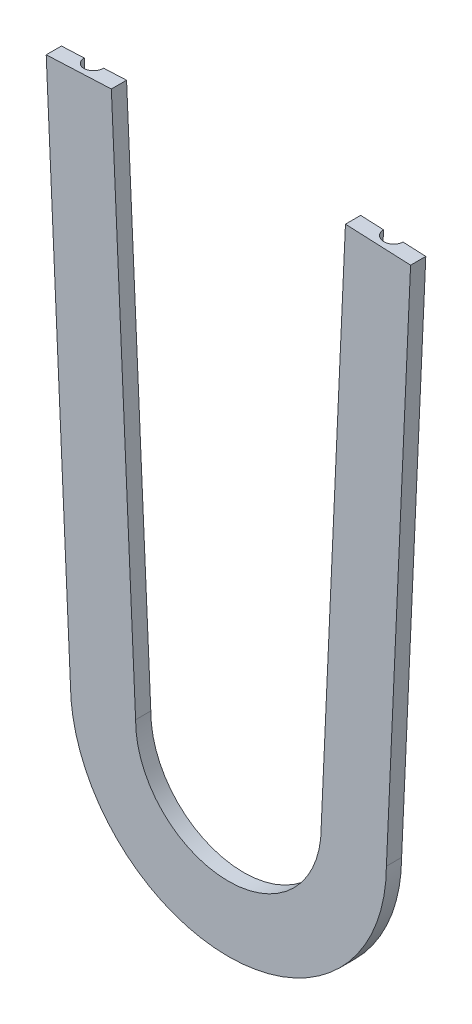
ISO-10303-21;
HEADER;
FILE_DESCRIPTION(('STEP AP214'),'2;1');
FILE_NAME('part.step','',(''),(''),'','','');
FILE_SCHEMA(('AUTOMOTIVE_DESIGN { 1 0 10303 214 1 1 1 1 }'));
ENDSEC;
DATA;
#1=APPLICATION_CONTEXT('core data for automotive mechanical design processes');
#2=APPLICATION_PROTOCOL_DEFINITION('international standard','automotive_design',2000,#1);
#3=PRODUCT_CONTEXT('',#1,'mechanical');
#4=PRODUCT('Part','Part','',(#3));
#5=PRODUCT_RELATED_PRODUCT_CATEGORY('part','',(#4));
#6=PRODUCT_DEFINITION_FORMATION('','',#4);
#7=PRODUCT_DEFINITION_CONTEXT('part definition',#1,'design');
#8=PRODUCT_DEFINITION('design','',#6,#7);
#9=PRODUCT_DEFINITION_SHAPE('','',#8);
#10=(LENGTH_UNIT() NAMED_UNIT(*) SI_UNIT(.MILLI.,.METRE.));
#11=(NAMED_UNIT(*) PLANE_ANGLE_UNIT() SI_UNIT($,.RADIAN.));
#12=(NAMED_UNIT(*) SI_UNIT($,.STERADIAN.) SOLID_ANGLE_UNIT());
#13=UNCERTAINTY_MEASURE_WITH_UNIT(LENGTH_MEASURE(1.E-05),#10,'distance_accuracy_value','');
#14=(GEOMETRIC_REPRESENTATION_CONTEXT(3) GLOBAL_UNCERTAINTY_ASSIGNED_CONTEXT((#13)) GLOBAL_UNIT_ASSIGNED_CONTEXT((#10,
#11,#12)) REPRESENTATION_CONTEXT('',''));
#15=CARTESIAN_POINT('',(0.,0.,0.));
#16=DIRECTION('',(0.,0.,1.));
#17=DIRECTION('',(1.,0.,0.));
#18=AXIS2_PLACEMENT_3D('',#15,#16,#17);
#19=CARTESIAN_POINT('',(0.,-604.4946,2.9464));
#20=DIRECTION('',(0.,0.,1.));
#21=DIRECTION('',(1.,0.,0.));
#22=AXIS2_PLACEMENT_3D('',#19,#20,#21);
#23=CYLINDRICAL_SURFACE('',#22,24.003);
#24=DIRECTION('',(0.,0.,-1.));
#25=VECTOR('',#24,1.);
#26=CARTESIAN_POINT('',(24.0027055961212,-604.613482570464,4.1021));
#27=LINE('',#26,#25);
#28=CARTESIAN_POINT('',(24.0027055961255,-604.613482570368,2.9464));
#29=VERTEX_POINT('',#28);
#30=CARTESIAN_POINT('',(24.0027055961255,-604.613482570368,5.2578));
#31=VERTEX_POINT('',#30);
#32=EDGE_CURVE('E268',#29,#31,#27,.F.);
#33=ORIENTED_EDGE('',*,*,#32,.T.);
#34=CARTESIAN_POINT('',(0.,-604.4946,5.2578));
#35=DIRECTION('',(0.,0.,1.));
#36=DIRECTION('',(1.,0.,0.));
#37=AXIS2_PLACEMENT_3D('',#34,#35,#36);
#38=CIRCLE('',#37,24.003);
#39=CARTESIAN_POINT('',(-24.0027055961255,-604.613482570368,5.2578));
#40=VERTEX_POINT('',#39);
#41=EDGE_CURVE('E162',#31,#40,#38,.F.);
#42=ORIENTED_EDGE('',*,*,#41,.T.);
#43=DIRECTION('',(0.,0.,1.));
#44=VECTOR('',#43,1.);
#45=CARTESIAN_POINT('',(-24.0027055961212,-604.613482570464,4.1021));
#46=LINE('',#45,#44);
#47=CARTESIAN_POINT('',(-24.0027055961249,-604.6134825705,2.9464));
#48=VERTEX_POINT('',#47);
#49=EDGE_CURVE('E271',#40,#48,#46,.F.);
#50=ORIENTED_EDGE('',*,*,#49,.T.);
#51=CARTESIAN_POINT('',(0.,-604.4946,2.9464));
#52=DIRECTION('',(0.,0.,1.));
#53=DIRECTION('',(1.,0.,0.));
#54=AXIS2_PLACEMENT_3D('',#51,#52,#53);
#55=CIRCLE('',#54,24.003);
#56=EDGE_CURVE('E158',#48,#29,#55,.T.);
#57=ORIENTED_EDGE('',*,*,#56,.T.);
#58=EDGE_LOOP('',(#33,#42,#50,#57));
#59=FACE_BOUND('',#58,.T.);
#60=ADVANCED_FACE('F17',(#59),#23,.T.);
#61=CARTESIAN_POINT('',(23.9292209206903,-606.231740783014,5.40652058941116));
#62=DIRECTION('',(0.998970569790712,-0.0453629881293202,0.));
#63=DIRECTION('',(0.,0.,-1.));
#64=AXIS2_PLACEMENT_3D('',#61,#62,#63);
#65=PLANE('',#64);
#66=DIRECTION('',(0.,0.,-1.));
#67=VECTOR('',#66,1.);
#68=CARTESIAN_POINT('',(27.6769393680293,-523.700571934905,4.1021));
#69=LINE('',#68,#67);
#70=CARTESIAN_POINT('',(27.6769393680304,-523.700571934905,2.9464));
#71=VERTEX_POINT('',#70);
#72=CARTESIAN_POINT('',(27.6769393680304,-523.700571934905,5.2578));
#73=VERTEX_POINT('',#72);
#74=EDGE_CURVE('E119',#71,#73,#69,.F.);
#75=ORIENTED_EDGE('',*,*,#74,.T.);
#76=DIRECTION('',(0.0453629881293202,0.998970569790712,0.));
#77=VECTOR('',#76,1.);
#78=CARTESIAN_POINT('',(23.9292209206903,-606.231740783014,5.2578));
#79=LINE('',#78,#77);
#80=EDGE_CURVE('E165',#73,#31,#79,.F.);
#81=ORIENTED_EDGE('',*,*,#80,.T.);
#82=ORIENTED_EDGE('',*,*,#32,.F.);
#83=DIRECTION('',(0.0453629881293202,0.998970569790712,0.));
#84=VECTOR('',#83,1.);
#85=CARTESIAN_POINT('',(23.9292209206903,-606.231740783014,2.9464));
#86=LINE('',#85,#84);
#87=EDGE_CURVE('E155',#29,#71,#86,.T.);
#88=ORIENTED_EDGE('',*,*,#87,.T.);
#89=EDGE_LOOP('',(#75,#81,#82,#88));
#90=FACE_BOUND('',#89,.T.);
#91=ADVANCED_FACE('F210',(#90),#65,.T.);
#92=CARTESIAN_POINT('',(20.5156996482297,-604.4946,2.79793188497368));
#93=CARTESIAN_POINT('',(20.6097988247181,-604.4946,3.72689316297742));
#94=CARTESIAN_POINT('',(19.9837150052592,-604.4946,4.41960000000006));
#95=CARTESIAN_POINT('',(19.05,-604.4946,4.41960000000006));
#96=CARTESIAN_POINT('',(18.1162849947408,-604.4946,4.41960000000006));
#97=CARTESIAN_POINT('',(17.490201175282,-604.4946,3.72689316297743));
#98=CARTESIAN_POINT('',(17.5843003517703,-604.4946,2.79793188497369));
#99=(BOUNDED_CURVE() B_SPLINE_CURVE(3,(#92,#93,#94,#95,#96,#97,#98),.UNSPECIFIED.,.F.,
.F.) B_SPLINE_CURVE_WITH_KNOTS((4,3,4),(0.,0.5,1.),
.UNSPECIFIED.) CURVE() GEOMETRIC_REPRESENTATION_ITEM() RATIONAL_B_SPLINE_CURVE((1.,
0.780353259779448,0.780353259779448,1.,0.780353259779448,0.780353259779448,1.)) REPRESENTATION_ITEM(''));
#100=CARTESIAN_POINT('',(0.,-604.4946,2.9464));
#101=DIRECTION('',(0.,0.,1.));
#102=AXIS1_PLACEMENT('',#100,#101);
#103=SURFACE_OF_REVOLUTION('',#99,#102);
#104=CARTESIAN_POINT('',(0.,-604.4946,2.9464));
#105=DIRECTION('',(0.,0.,1.));
#106=DIRECTION('',(1.,0.,0.));
#107=AXIS2_PLACEMENT_3D('',#104,#105,#106);
#108=CIRCLE('',#107,17.5767999999999);
#109=CARTESIAN_POINT('',(-17.5767694718907,-604.461840696414,2.94640000000061));
#110=VERTEX_POINT('',#109);
#111=CARTESIAN_POINT('',(17.5767694718895,-604.461840696414,2.9464));
#112=VERTEX_POINT('',#111);
#113=EDGE_CURVE('E135',#110,#112,#108,.T.);
#114=ORIENTED_EDGE('',*,*,#113,.T.);
#115=CARTESIAN_POINT('',(17.5767694718918,-604.461840696456,2.9464));
#116=CARTESIAN_POINT('',(17.5767688221751,-604.461832932138,2.97182810443926));
#117=CARTESIAN_POINT('',(17.5774277934015,-604.461837424337,2.99725616400642));
#118=CARTESIAN_POINT('',(17.5800617910486,-604.461870995725,3.04807052445029));
#119=CARTESIAN_POINT('',(17.5820381844576,-604.46190010046,3.0734567544667));
#120=CARTESIAN_POINT('',(17.5873018142634,-604.461982955642,3.12407332937669));
#121=CARTESIAN_POINT('',(17.5905880490891,-604.462036687263,3.1493037784536));
#122=CARTESIAN_POINT('',(17.5984521959019,-604.462168979468,3.19949590470834));
#123=CARTESIAN_POINT('',(17.603026759417,-604.462247475749,3.22445810674525));
#124=CARTESIAN_POINT('',(17.6134359270406,-604.4624295228,3.27400385820773));
#125=CARTESIAN_POINT('',(17.6192649110141,-604.46253296206,3.29858858889272));
#126=CARTESIAN_POINT('',(17.6321390739764,-604.462765181506,3.34727428993361));
#127=CARTESIAN_POINT('',(17.639176487765,-604.462893800585,3.37137731466718));
#128=CARTESIAN_POINT('',(17.6544124086054,-604.463176716781,3.41900087835389));
#129=CARTESIAN_POINT('',(17.6626011772786,-604.463330800258,3.44252453448193));
#130=CARTESIAN_POINT('',(17.6800745405739,-604.463665029549,3.48889844539359));
#131=CARTESIAN_POINT('',(17.6893476342921,-604.463844905724,3.51175303612439));
#132=CARTESIAN_POINT('',(17.708915537346,-604.464231143573,3.5567069083712));
#133=CARTESIAN_POINT('',(17.719197324151,-604.464437175724,3.57881186202356));
#134=CARTESIAN_POINT('',(17.7407011255539,-604.464876186337,3.62219449990189));
#135=CARTESIAN_POINT('',(17.751908858005,-604.465108771081,3.64347926843088));
#136=CARTESIAN_POINT('',(17.7751772503105,-604.465601356972,3.68516019003239));
#137=CARTESIAN_POINT('',(17.7872226419937,-604.465860895915,3.70556487324147));
#138=CARTESIAN_POINT('',(17.8120748390949,-604.466407938424,3.74543527512716));
#139=CARTESIAN_POINT('',(17.8248656663192,-604.466694905646,3.76491096228488));
#140=CARTESIAN_POINT('',(17.8511146133219,-604.467297145185,3.80288414988828));
#141=CARTESIAN_POINT('',(17.8645563144158,-604.467611806026,3.82139301100583));
#142=CARTESIAN_POINT('',(17.892011755078,-604.468270570325,3.85740426252524));
#143=CARTESIAN_POINT('',(17.9060088923428,-604.468613967223,3.87491932638239));
#144=CARTESIAN_POINT('',(17.9344804455695,-604.469328462663,3.90892546218932));
#145=CARTESIAN_POINT('',(17.94893830861,-604.469698813925,3.92543040818585));
#146=CARTESIAN_POINT('',(17.9782376197692,-604.470475863964,3.9574083151908));
#147=CARTESIAN_POINT('',(17.9930627885425,-604.470881540585,3.97289623029617));
#148=CARTESIAN_POINT('',(18.0263723282335,-604.471792374919,4.00620808617536));
#149=CARTESIAN_POINT('',(18.0450006072147,-604.472301342113,4.02388838889358));
#150=CARTESIAN_POINT('',(18.0831042593972,-604.473308724553,4.0582051625648));
#151=CARTESIAN_POINT('',(18.1025772284713,-604.473807164423,4.07484430411933));
#152=CARTESIAN_POINT('',(18.1422837811839,-604.474803224291,4.10702026953493));
#153=CARTESIAN_POINT('',(18.1625139853923,-604.475300839506,4.12256126328019));
#154=CARTESIAN_POINT('',(18.2036432767,-604.476292952307,4.15249182256927));
#155=CARTESIAN_POINT('',(18.2245381998087,-604.476787452314,4.16688711058257));
#156=CARTESIAN_POINT('',(18.2669017110995,-604.47777421062,4.19448744094801));
#157=CARTESIAN_POINT('',(18.2883655486972,-604.4782664619,4.20769977553701));
#158=CARTESIAN_POINT('',(18.3317694405629,-604.479248713048,4.23290577430237));
#159=CARTESIAN_POINT('',(18.3537043586186,-604.479738699745,4.24490828410737));
#160=CARTESIAN_POINT('',(18.397952124221,-604.480716605598,4.26767664714874));
#161=CARTESIAN_POINT('',(18.4202596471094,-604.481204502381,4.27845285020601));
#162=CARTESIAN_POINT('',(18.4651548047999,-604.482178318226,4.29876085121562));
#163=CARTESIAN_POINT('',(18.4877371146083,-604.482664205096,4.30830442412156));
#164=CARTESIAN_POINT('',(18.5330857386982,-604.48363407323,4.32614927674899));
#165=CARTESIAN_POINT('',(18.5558469018117,-604.484118011507,4.33446365117978));
#166=CARTESIAN_POINT('',(18.6014599669704,-604.485084017517,4.34986153426088));
#167=CARTESIAN_POINT('',(18.6243070480054,-604.48556603099,4.35695933003548));
#168=CARTESIAN_POINT('',(18.6700025297634,-604.486528192117,4.36994411434237));
#169=CARTESIAN_POINT('',(18.6928465752177,-604.487008273976,4.37584643789769));
#170=CARTESIAN_POINT('',(18.7384512729855,-604.487966546722,4.38646817770951));
#171=CARTESIAN_POINT('',(18.7612081487245,-604.488444660292,4.39120382010459));
#172=CARTESIAN_POINT('',(18.8065592083433,-604.489398944084,4.39952705135966));
#173=CARTESIAN_POINT('',(18.8291502837574,-604.489875025703,4.40313159361775));
#174=CARTESIAN_POINT('',(18.8740964064951,-604.490825168376,4.40923355844007));
#175=CARTESIAN_POINT('',(18.8964490794027,-604.491299129979,4.41174849439087));
#176=CARTESIAN_POINT('',(18.9408514276556,-604.492244933669,4.41571712847101));
#177=CARTESIAN_POINT('',(18.9628995057489,-604.492716666062,4.41718873750584));
#178=CARTESIAN_POINT('',(19.0066322815478,-604.493657892368,4.41912127413196));
#179=CARTESIAN_POINT('',(19.0283161815787,-604.494127267108,4.41960034110269));
#180=CARTESIAN_POINT('',(19.0499999999999,-604.4946,4.41960000000006));
#181=B_SPLINE_CURVE_WITH_KNOTS('',3,(#115,#116,#117,#118,#119,#120,#121,#122,#123,#124,#125,
#126,#127,#128,#129,#130,#131,#132,#133,#134,#135,#136,#137,#138,#139,#140,#141,#142,#143,#144,
#145,#146,#147,#148,#149,#150,#151,#152,#153,#154,#155,#156,#157,#158,#159,#160,#161,#162,#163,
#164,#165,#166,#167,#168,#169,#170,#171,#172,#173,#174,#175,#176,#177,#178,#179,#180),
.UNSPECIFIED.,.F.,.F.,(4,2,2,2,2,2,2,2,2,2,2,2,2,2,2,2,2,2,2,2,2,2,2,2,2,2,2,2,2,2,2,2,4),(0.,
0.0762757142904738,0.152630697511329,0.228927407509762,0.305027617710409,0.380793724839522,
0.456090039470174,0.530784028628657,0.604747481818089,0.677857575135833,0.749997812457862,
0.821058827651034,0.890939037138229,0.959545137565407,1.02679244851112,1.09260510489128,
1.15691610775577,1.23394344447498,1.31076433824077,1.38727582005754,1.46337741001955,
1.53897188043441,1.61396595550751,1.68827093598453,1.76180323973169,1.83448485199606,
1.9062436818919,1.97701382437458,2.04673572947713,2.11535628280573,2.18282880315587,
2.2491129645812,2.31417465131182),.UNSPECIFIED.);
#182=CARTESIAN_POINT('',(19.05,-604.4946,4.41960000000331));
#183=VERTEX_POINT('',#182);
#184=EDGE_CURVE('E120',#112,#183,#181,.T.);
#185=ORIENTED_EDGE('',*,*,#184,.T.);
#186=CARTESIAN_POINT('',(19.0499999999999,-604.4946,4.41960000000006));
#187=CARTESIAN_POINT('',(19.0704812848332,-604.495054903607,4.41960026390472));
#188=CARTESIAN_POINT('',(19.0909625960444,-604.495507013949,4.41917289414008));
#189=CARTESIAN_POINT('',(19.1316157404041,-604.496400122163,4.41747621351175));
#190=CARTESIAN_POINT('',(19.1517880461415,-604.496841187775,4.41621824995317));
#191=CARTESIAN_POINT('',(19.1917504012226,-604.497712001864,4.41289949509327));
#192=CARTESIAN_POINT('',(19.2115415128865,-604.498141819633,4.41085150584536));
#193=CARTESIAN_POINT('',(19.25067365338,-604.498989911692,4.40599922325951));
#194=CARTESIAN_POINT('',(19.270016428946,-604.499408255359,4.40320902183303));
#195=CARTESIAN_POINT('',(19.3081897431436,-604.500233167045,4.39692491467345));
#196=CARTESIAN_POINT('',(19.3270227844711,-604.500639803145,4.3934462144664));
#197=CARTESIAN_POINT('',(19.3641207370429,-604.501441061502,4.38584299290195));
#198=CARTESIAN_POINT('',(19.3823889534656,-604.501835749482,4.3817345992682));
#199=CARTESIAN_POINT('',(19.4183080393722,-604.502612871357,4.37293414289382));
#200=CARTESIAN_POINT('',(19.4359630377445,-604.502995367786,4.36825893205026));
#201=CARTESIAN_POINT('',(19.470613395538,-604.50374786698,4.35839026637256));
#202=CARTESIAN_POINT('',(19.4876137041073,-604.504117928495,4.35321418767368));
#203=CARTESIAN_POINT('',(19.5209194018604,-604.504845321777,4.34241148132214));
#204=CARTESIAN_POINT('',(19.5372305338281,-604.505202708127,4.33680255758241));
#205=CARTESIAN_POINT('',(19.5691295366957,-604.505904520791,4.32520316241555));
#206=CARTESIAN_POINT('',(19.5847238967027,-604.506248997329,4.31923053398668));
#207=CARTESIAN_POINT('',(19.615167766044,-604.506924768508,4.30697311233065));
#208=CARTESIAN_POINT('',(19.6300244448736,-604.507256108977,4.30070612451757));
#209=CARTESIAN_POINT('',(19.6589777216829,-604.507905394616,4.28792895329318));
#210=CARTESIAN_POINT('',(19.6730820911506,-604.50822338139,4.28143637407198));
#211=CARTESIAN_POINT('',(19.7005216904232,-604.508845762292,4.26827567317165));
#212=CARTESIAN_POINT('',(19.7138651949219,-604.509150193864,4.26162481314416));
#213=CARTESIAN_POINT('',(19.7397788381169,-604.509745262409,4.24821376855113));
#214=CARTESIAN_POINT('',(19.7523576815586,-604.510035933715,4.24147035803439));
#215=CARTESIAN_POINT('',(19.7880681851056,-604.51086680882,4.22165272525711));
#216=CARTESIAN_POINT('',(19.8109533782851,-604.511406210295,4.20813026327418));
#217=CARTESIAN_POINT('',(19.8536574622741,-604.512427827609,4.18131266426529));
#218=CARTESIAN_POINT('',(19.8735507132221,-604.512910254392,4.16813550904934));
#219=CARTESIAN_POINT('',(19.9103809680061,-604.513816968243,4.14243107736881));
#220=CARTESIAN_POINT('',(19.927391177791,-604.514241442243,4.13000865684453));
#221=CARTESIAN_POINT('',(19.9585949712799,-604.515031316485,4.10617835273115));
#222=CARTESIAN_POINT('',(19.9728578464678,-604.515396926222,4.09486114324349));
#223=CARTESIAN_POINT('',(19.9987205723937,-604.51606865003,4.07354688483802));
#224=CARTESIAN_POINT('',(20.0103833343648,-604.516374983056,4.06362595545849));
#225=CARTESIAN_POINT('',(20.0383056666797,-604.517115198784,4.03911325705635));
#226=CARTESIAN_POINT('',(20.0544027819445,-604.517547720985,4.0243350851679));
#227=CARTESIAN_POINT('',(20.07485847464,-604.518103100872,4.0046993692973));
#228=CARTESIAN_POINT('',(20.0795253211047,-604.518230209125,4.00015975015493));
#229=CARTESIAN_POINT('',(20.0866984534164,-604.51841735287,3.99308904919615));
#230=CARTESIAN_POINT('',(20.0892259098253,-604.518481691251,3.99057955312355));
#231=CARTESIAN_POINT('',(20.1095238414314,-604.518988979472,3.97027909611339));
#232=CARTESIAN_POINT('',(20.1268516310124,-604.519363627777,3.95203830129391));
#233=CARTESIAN_POINT('',(20.1605505953086,-604.520120262109,3.91469360641474));
#234=CARTESIAN_POINT('',(20.176921685446,-604.520502248782,3.89558963030868));
#235=CARTESIAN_POINT('',(20.208645668847,-604.521233835743,3.85659161843916));
#236=CARTESIAN_POINT('',(20.2239997805053,-604.521583474992,3.83669857546287));
#237=CARTESIAN_POINT('',(20.2536333093118,-604.522260476795,3.79620442698831));
#238=CARTESIAN_POINT('',(20.2679153402274,-604.522587893329,3.7756052346022));
#239=CARTESIAN_POINT('',(20.2953578801033,-604.523217232862,3.73378482874355));
#240=CARTESIAN_POINT('',(20.3085224589017,-604.523519248333,3.71256628739087));
#241=CARTESIAN_POINT('',(20.3336923650376,-604.524098171165,3.66959710072581));
#242=CARTESIAN_POINT('',(20.3457032507125,-604.524375198475,3.64784971269118));
#243=CARTESIAN_POINT('',(20.3685377102852,-604.524903610477,3.60391512092104));
#244=CARTESIAN_POINT('',(20.3793683316263,-604.525155146664,3.5817315816135));
#245=CARTESIAN_POINT('',(20.3998238943948,-604.525632332776,3.53701817580138));
#246=CARTESIAN_POINT('',(20.4094573431027,-604.525858164265,3.51449220282907));
#247=CARTESIAN_POINT('',(20.4275098152921,-604.526283668563,3.46918737770951));
#248=CARTESIAN_POINT('',(20.4359387480108,-604.526483553408,3.44641247564254));
#249=CARTESIAN_POINT('',(20.4515827950799,-604.526856950049,3.40070203691533));
#250=CARTESIAN_POINT('',(20.4588091369372,-604.527030704137,3.37777034425173));
#251=CARTESIAN_POINT('',(20.4720575360495,-604.527351660817,3.33183627664267));
#252=CARTESIAN_POINT('',(20.478092032961,-604.527499135905,3.30883749086651));
#253=CARTESIAN_POINT('',(20.4889746418258,-604.527767397551,3.26285591380229));
#254=CARTESIAN_POINT('',(20.4938362809494,-604.527888486679,3.23987632510572));
#255=CARTESIAN_POINT('',(20.5023987451432,-604.52810387918,3.19401568009945));
#256=CARTESIAN_POINT('',(20.5061140462679,-604.528198515035,3.17113732732311));
#257=CARTESIAN_POINT('',(20.5124163616109,-604.528360938943,3.12555682665382));
#258=CARTESIAN_POINT('',(20.5150186516442,-604.528429089229,3.1028567913681));
#259=CARTESIAN_POINT('',(20.5191333973779,-604.528538525598,3.05770513462279));
#260=CARTESIAN_POINT('',(20.5206617769895,-604.528580203282,3.03525496430048));
#261=CARTESIAN_POINT('',(20.5226729346885,-604.528636674839,2.99066936936566));
#262=CARTESIAN_POINT('',(20.5231721206259,-604.528651889965,2.9685346843213));
#263=CARTESIAN_POINT('',(20.5231717476144,-604.528653750536,2.9464));
#264=B_SPLINE_CURVE_WITH_KNOTS('',3,(#186,#187,#188,#189,#190,#191,#192,#193,#194,#195,#196,
#197,#198,#199,#200,#201,#202,#203,#204,#205,#206,#207,#208,#209,#210,#211,#212,#213,#214,#215,
#216,#217,#218,#219,#220,#221,#222,#223,#224,#225,#226,#227,#228,#229,#230,#231,#232,#233,#234,
#235,#236,#237,#238,#239,#240,#241,#242,#243,#244,#245,#246,#247,#248,#249,#250,#251,#252,#253,
#254,#255,#256,#257,#258,#259,#260,#261,#262,#263),.UNSPECIFIED.,.F.,.F.,(4,2,2,2,2,2,2,2,2,2,2,
2,2,2,2,2,2,2,2,2,2,2,2,2,2,2,2,2,2,2,2,2,2,2,2,2,2,2,4),(0.,0.0614544705741428,
0.122086275360216,0.181774254381958,0.240401168512197,0.2978544399828,0.354026791200259,
0.408816773509848,0.462129181240885,0.5138753499545,0.563973341142432,0.61234801856229,
0.658931023851332,0.703660660983625,0.746481700511611,0.826200473344976,0.897772789996084,
0.960956172794855,1.01557645834792,1.06151416360312,1.12705726442554,1.14659235674816,
1.15727914363559,1.23272652666714,1.30818056963037,1.38354251536967,1.45871431912662,
1.53359940958598,1.6081034213748,1.68213488542789,1.75560586511637,1.82843252789648,
1.90053564437337,1.97184100897814,2.04227977881398,2.11178872953268,2.18031042926114,
2.24779333353185,2.31419180582457),.UNSPECIFIED.);
#265=CARTESIAN_POINT('',(20.5231717476165,-604.52865375058,2.9464));
#266=VERTEX_POINT('',#265);
#267=EDGE_CURVE('E270',#183,#266,#264,.T.);
#268=ORIENTED_EDGE('',*,*,#267,.T.);
#269=CARTESIAN_POINT('',(0.,-604.4946,2.9464));
#270=DIRECTION('',(0.,0.,1.));
#271=DIRECTION('',(1.,0.,0.));
#272=AXIS2_PLACEMENT_3D('',#269,#270,#271);
#273=CIRCLE('',#272,20.5232000000001);
#274=CARTESIAN_POINT('',(-20.5231717476199,-604.528653750581,2.9464));
#275=VERTEX_POINT('',#274);
#276=EDGE_CURVE('E145',#266,#275,#273,.F.);
#277=ORIENTED_EDGE('',*,*,#276,.T.);
#278=CARTESIAN_POINT('',(-20.5231717476144,-604.528653750536,2.9464));
#279=CARTESIAN_POINT('',(-20.5231721027367,-604.528654315365,2.96831773397548));
#280=CARTESIAN_POINT('',(-20.5226826575368,-604.528641354406,2.99023547237425));
#281=CARTESIAN_POINT('',(-20.520709553491,-604.528589148788,3.0344109638125));
#282=CARTESIAN_POINT('',(-20.5192086261975,-604.528549447617,3.0566679462237));
#283=CARTESIAN_POINT('',(-20.5151644894583,-604.528443717272,3.10145989014064));
#284=CARTESIAN_POINT('',(-20.5126043756829,-604.528377261589,3.12399332550861));
#285=CARTESIAN_POINT('',(-20.5063987276617,-604.528217972036,3.16926982893223));
#286=CARTESIAN_POINT('',(-20.5027368209168,-604.528124741316,3.19201065252942));
#287=CARTESIAN_POINT('',(-20.4942896101194,-604.527911896461,3.23762755600592));
#288=CARTESIAN_POINT('',(-20.4894886234044,-604.527791915566,3.26050073104002));
#289=CARTESIAN_POINT('',(-20.4787315196584,-604.527525599565,3.30630239587291));
#290=CARTESIAN_POINT('',(-20.4727605687257,-604.527378927961,3.32922740062119));
#291=CARTESIAN_POINT('',(-20.4596388570448,-604.527059299082,3.37504782018436));
#292=CARTESIAN_POINT('',(-20.4524742628412,-604.526886035742,3.39793927209269));
#293=CARTESIAN_POINT('',(-20.4369484504515,-604.526513334403,3.44360347033785));
#294=CARTESIAN_POINT('',(-20.4285745400645,-604.526313620922,3.46637189973475));
#295=CARTESIAN_POINT('',(-20.410621850457,-604.525888163382,3.51169761815666));
#296=CARTESIAN_POINT('',(-20.4010316453183,-604.525662174431,3.53425037983527));
#297=CARTESIAN_POINT('',(-20.3806472796685,-604.525184382315,3.57905003138675));
#298=CARTESIAN_POINT('',(-20.369843064317,-604.52493236521,3.60129234436649));
#299=CARTESIAN_POINT('',(-20.3470412015446,-604.524402655574,3.64537519663182));
#300=CARTESIAN_POINT('',(-20.3350349508721,-604.524124779129,3.66721128400004));
#301=CARTESIAN_POINT('',(-20.3098494083774,-604.523543973163,3.71038585200198));
#302=CARTESIAN_POINT('',(-20.2966630174384,-604.523240892925,3.73172018973602));
#303=CARTESIAN_POINT('',(-20.2691476323842,-604.522608659743,3.77379669299588));
#304=CARTESIAN_POINT('',(-20.2548130659027,-604.522279379704,3.79453521255021));
#305=CARTESIAN_POINT('',(-20.2250413993362,-604.521600072722,3.83532837759756));
#306=CARTESIAN_POINT('',(-20.2096002427363,-604.521249970339,3.85538006215414));
#307=CARTESIAN_POINT('',(-20.1776659775653,-604.520510665636,3.89471090710023));
#308=CARTESIAN_POINT('',(-20.1611702889613,-604.520121365966,3.9139879689992));
#309=CARTESIAN_POINT('',(-20.1271831152614,-604.519374186546,3.95168935474278));
#310=CARTESIAN_POINT('',(-20.1096904464359,-604.519016345484,3.97011261575865));
#311=CARTESIAN_POINT('',(-20.0862394839597,-604.518398414452,3.99356630778662));
#312=CARTESIAN_POINT('',(-20.0806982286221,-604.518242734053,3.99902111883015));
#313=CARTESIAN_POINT('',(-20.0605985833834,-604.517682379082,4.01849622015164));
#314=CARTESIAN_POINT('',(-20.0457922726824,-604.517277680687,4.03226320309341));
#315=CARTESIAN_POINT('',(-20.019706425323,-604.516575220245,4.05553562146295));
#316=CARTESIAN_POINT('',(-20.0085559756208,-604.516278136251,4.06518668661289));
#317=CARTESIAN_POINT('',(-19.9836233888254,-604.515622013553,4.08612019137612));
#318=CARTESIAN_POINT('',(-19.9697758352239,-604.51526292784,4.09732493424928));
#319=CARTESIAN_POINT('',(-19.9392971557765,-604.5144831798,4.12108520195413));
#320=CARTESIAN_POINT('',(-19.922592782763,-604.514062419662,4.13354684193675));
#321=CARTESIAN_POINT('',(-19.8862540636987,-604.513160282795,4.15947443356139));
#322=CARTESIAN_POINT('',(-19.8665413231674,-604.512678809785,4.17283055689165));
#323=CARTESIAN_POINT('',(-19.8240614301276,-604.511656290333,4.20013368671603));
#324=CARTESIAN_POINT('',(-19.8012137809544,-604.511115100433,4.21395591640943));
#325=CARTESIAN_POINT('',(-19.7654946461555,-604.510280738901,4.23426027899934));
#326=CARTESIAN_POINT('',(-19.7528756591765,-604.509988152393,4.24119067772532));
#327=CARTESIAN_POINT('',(-19.7268406776049,-604.509388584787,4.25499642785219));
#328=CARTESIAN_POINT('',(-19.7134151335887,-604.509081574631,4.26185382010562));
#329=CARTESIAN_POINT('',(-19.6857688194101,-604.50845337882,4.2754438593619));
#330=CARTESIAN_POINT('',(-19.6715389365941,-604.508132159993,4.28215795930889));
#331=CARTESIAN_POINT('',(-19.6422907830007,-604.507475764968,4.29538956056721));
#332=CARTESIAN_POINT('',(-19.6272639239902,-604.507140550405,4.30188808497349));
#333=CARTESIAN_POINT('',(-19.5964351090552,-604.506456399832,4.31461468282353));
#334=CARTESIAN_POINT('',(-19.5806252049687,-604.506107420224,4.32082350502025));
#335=CARTESIAN_POINT('',(-19.5482503589704,-604.505395985767,4.33289577993993));
#336=CARTESIAN_POINT('',(-19.5316782027217,-604.505033481924,4.33873988889534));
#337=CARTESIAN_POINT('',(-19.4978061803944,-604.504295254901,4.35000760767113));
#338=CARTESIAN_POINT('',(-19.4804999137633,-604.503919477388,4.35541197916));
#339=CARTESIAN_POINT('',(-19.4451945592579,-604.503154965455,4.36572588908032));
#340=CARTESIAN_POINT('',(-19.427189943659,-604.502766171585,4.37061650756364));
#341=CARTESIAN_POINT('',(-19.3905305049491,-604.501975892914,4.37983044293396));
#342=CARTESIAN_POINT('',(-19.3718710623663,-604.50157434398,4.38413538133952));
#343=CARTESIAN_POINT('',(-19.3339522961736,-604.50075882108,4.39210848434211));
#344=CARTESIAN_POINT('',(-19.31468927003,-604.50034477897,4.39575904012622));
#345=CARTESIAN_POINT('',(-19.2756211791098,-604.499504531948,4.40235804354764));
#346=CARTESIAN_POINT('',(-19.2558133086962,-604.499078255821,4.40528987900302));
#347=CARTESIAN_POINT('',(-19.2157204972424,-604.498213794363,4.41039142228171));
#348=CARTESIAN_POINT('',(-19.1954335977801,-604.49777553595,4.41254573463423));
#349=CARTESIAN_POINT('',(-19.1544542275484,-604.496887354182,4.41603847924431));
#350=CARTESIAN_POINT('',(-19.1337605664297,-604.496437357445,4.41736293578106));
#351=CARTESIAN_POINT('',(-19.092044948216,-604.49552591655,4.41915002551012));
#352=CARTESIAN_POINT('',(-19.071022462373,-604.49506440038,4.41960029278877));
#353=CARTESIAN_POINT('',(-19.0499999999999,-604.4946,4.41960000000006));
#354=B_SPLINE_CURVE_WITH_KNOTS('',3,(#278,#279,#280,#281,#282,#283,#284,#285,#286,#287,#288,
#289,#290,#291,#292,#293,#294,#295,#296,#297,#298,#299,#300,#301,#302,#303,#304,#305,#306,#307,
#308,#309,#310,#311,#312,#313,#314,#315,#316,#317,#318,#319,#320,#321,#322,#323,#324,#325,#326,
#327,#328,#329,#330,#331,#332,#333,#334,#335,#336,#337,#338,#339,#340,#341,#342,#343,#344,#345,
#346,#347,#348,#349,#350,#351,#352,#353),.UNSPECIFIED.,.F.,.F.,(4,2,2,2,2,2,2,2,2,2,2,2,2,2,2,2,
2,2,2,2,2,2,2,2,2,2,2,2,2,2,2,2,2,2,2,2,2,4),(0.,0.0657477901151504,0.132647485541912,
0.200658797279614,0.269735345147605,0.339824599986281,0.410867897847443,0.482800532672695,
0.555551932544145,0.629045922827452,0.703201077451283,0.777931157240886,0.853145631731176,
0.928750278329714,1.00464785019939,1.08073880190889,1.15692205987796,1.1802532968102,
1.24089812346454,1.28514261202846,1.3385802732736,1.40109582892632,1.47251723810536,
1.55260025966384,1.59579460478483,1.64102291246815,1.68822770937761,1.73734441900341,
1.78830111121355,1.84101834171988,1.89540909500993,1.95137884278159,2.00882572771041,
2.06764087948619,2.12770886653358,2.18890828278851,2.25111246449825,2.31419032745121),.UNSPECIFIED.);
#355=CARTESIAN_POINT('',(-19.05,-604.4946,4.41960000000378));
#356=VERTEX_POINT('',#355);
#357=EDGE_CURVE('E191',#275,#356,#354,.T.);
#358=ORIENTED_EDGE('',*,*,#357,.T.);
#359=CARTESIAN_POINT('',(-19.0499999999999,-604.4946,4.41960000000006));
#360=CARTESIAN_POINT('',(-19.0283167763317,-604.494020535502,4.41960034246529));
#361=CARTESIAN_POINT('',(-19.0066332376235,-604.493452537755,4.41912130043692));
#362=CARTESIAN_POINT('',(-18.9629011736056,-604.492327612385,4.41718882960783));
#363=CARTESIAN_POINT('',(-18.9408534372271,-604.491771092687,4.4157172796177));
#364=CARTESIAN_POINT('',(-18.8964517613742,-604.490669133604,4.4117487793694));
#365=CARTESIAN_POINT('',(-18.8740994105965,-604.490124071217,4.409233935045));
#366=CARTESIAN_POINT('',(-18.8291539200996,-604.48904504038,4.40313217048717));
#367=CARTESIAN_POINT('',(-18.8065631464288,-604.488511418027,4.39952775245453));
#368=CARTESIAN_POINT('',(-18.7612126773355,-604.487455245874,4.3912047867542));
#369=CARTESIAN_POINT('',(-18.7384560822096,-604.486933010848,4.38646930008997));
#370=CARTESIAN_POINT('',(-18.6928519316802,-604.485899564988,4.37584788843192));
#371=CARTESIAN_POINT('',(-18.6700081448838,-604.485388637597,4.36994575059383));
#372=CARTESIAN_POINT('',(-18.6243131654951,-604.484377727385,4.35696135328398));
#373=CARTESIAN_POINT('',(-18.601466320406,-604.483877996883,4.34986377105528));
#374=CARTESIAN_POINT('',(-18.5558537114016,-604.482889369096,4.33446632884753));
#375=CARTESIAN_POINT('',(-18.5330927609281,-604.4824006935,4.32615219306472));
#376=CARTESIAN_POINT('',(-18.487744545821,-604.481434032093,4.30830782903041));
#377=CARTESIAN_POINT('',(-18.4651624249731,-604.480956238119,4.29876451652891));
#378=CARTESIAN_POINT('',(-18.4202676288721,-604.480011162886,4.27845704468889));
#379=CARTESIAN_POINT('',(-18.3979602714019,-604.479544044656,4.2676811200837));
#380=CARTESIAN_POINT('',(-18.3537128201883,-604.478620117126,4.2449133181799));
#381=CARTESIAN_POINT('',(-18.331778044035,-604.478163443438,4.23291110005738));
#382=CARTESIAN_POINT('',(-18.2883744221256,-604.47726015218,4.20770568666325));
#383=CARTESIAN_POINT('',(-18.2669107056439,-604.476813644244,4.19449365417982));
#384=CARTESIAN_POINT('',(-18.2245474179286,-604.475930474302,4.16689391841263));
#385=CARTESIAN_POINT('',(-18.2036525903753,-604.475493898314,4.15249893075254));
#386=CARTESIAN_POINT('',(-18.1625234978798,-604.474630089528,4.12256898462108));
#387=CARTESIAN_POINT('',(-18.1422933901927,-604.474202919612,4.10702831127441));
#388=CARTESIAN_POINT('',(-18.1025869508144,-604.473358403428,4.07485289320879));
#389=CARTESIAN_POINT('',(-18.0831139914034,-604.472941103773,4.05821398543002));
#390=CARTESIAN_POINT('',(-18.0450106225014,-604.472113014555,4.0238979600298));
#391=CARTESIAN_POINT('',(-18.0263826109124,-604.471702245436,4.00621817950761));
#392=CARTESIAN_POINT('',(-17.9897241675848,-604.470890793887,3.96955755992206));
#393=CARTESIAN_POINT('',(-17.9717122841583,-604.470490460641,3.95055816022169));
#394=CARTESIAN_POINT('',(-17.9368164411678,-604.469720993151,3.91172732897541));
#395=CARTESIAN_POINT('',(-17.9199271281106,-604.469351708207,3.89190071076098));
#396=CARTESIAN_POINT('',(-17.8873304868649,-604.468640770225,3.85151357761017));
#397=CARTESIAN_POINT('',(-17.8716161025066,-604.468298951121,3.83095876045926));
#398=CARTESIAN_POINT('',(-17.8414120575861,-604.467643291939,3.78921728825517));
#399=CARTESIAN_POINT('',(-17.8269136263704,-604.4673292504,3.76803698229143));
#400=CARTESIAN_POINT('',(-17.7991726434046,-604.466728502816,3.72514891428864));
#401=CARTESIAN_POINT('',(-17.7859196348834,-604.466441569034,3.70344791853073));
#402=CARTESIAN_POINT('',(-17.7606891163027,-604.465894713221,3.65962363109227));
#403=CARTESIAN_POINT('',(-17.7486995291521,-604.465634536139,3.63750729488025));
#404=CARTESIAN_POINT('',(-17.726004203635,-604.46514084726,3.59295677621547));
#405=CARTESIAN_POINT('',(-17.7152848674761,-604.464907054623,3.57052952311885));
#406=CARTESIAN_POINT('',(-17.6951276107931,-604.46446585961,3.52545952686369));
#407=CARTESIAN_POINT('',(-17.6856747003964,-604.464258150774,3.50282348983404));
#408=CARTESIAN_POINT('',(-17.6680377468556,-604.463868896817,3.45743493937869));
#409=CARTESIAN_POINT('',(-17.6598374738712,-604.463687019663,3.43468873423778));
#410=CARTESIAN_POINT('',(-17.644683950211,-604.463349257523,3.38917442817992));
#411=CARTESIAN_POINT('',(-17.637713399407,-604.463193014554,3.36641208860973));
#412=CARTESIAN_POINT('',(-17.6249891132473,-604.462906401431,3.32095474450351));
#413=CARTESIAN_POINT('',(-17.6192171886923,-604.462775646714,3.29826483255612));
#414=CARTESIAN_POINT('',(-17.6088525950867,-604.462539941953,3.25303548976335));
#415=CARTESIAN_POINT('',(-17.6042410347817,-604.462434579894,3.23050038874523));
#416=CARTESIAN_POINT('',(-17.5961533261772,-604.462249638894,3.18565717553876));
#417=CARTESIAN_POINT('',(-17.592657771711,-604.462169619495,3.16335256371975));
#418=CARTESIAN_POINT('',(-17.5867529687523,-604.46203539201,3.11903982379345));
#419=CARTESIAN_POINT('',(-17.584323982806,-604.46198071381,3.09703432573399));
#420=CARTESIAN_POINT('',(-17.5804991725922,-604.461897219305,3.05338207600661));
#421=CARTESIAN_POINT('',(-17.5790834514007,-604.46186790244,3.03173706710496));
#422=CARTESIAN_POINT('',(-17.5772283767484,-604.461835284587,2.98886079390779));
#423=CARTESIAN_POINT('',(-17.5767691397497,-604.461831450082,2.96763038866618));
#424=CARTESIAN_POINT('',(-17.5767694718918,-604.461840696456,2.9464));
#425=B_SPLINE_CURVE_WITH_KNOTS('',3,(#359,#360,#361,#362,#363,#364,#365,#366,#367,#368,#369,
#370,#371,#372,#373,#374,#375,#376,#377,#378,#379,#380,#381,#382,#383,#384,#385,#386,#387,#388,
#389,#390,#391,#392,#393,#394,#395,#396,#397,#398,#399,#400,#401,#402,#403,#404,#405,#406,#407,
#408,#409,#410,#411,#412,#413,#414,#415,#416,#417,#418,#419,#420,#421,#422,#423,#424),
.UNSPECIFIED.,.F.,.F.,(4,2,2,2,2,2,2,2,2,2,2,2,2,2,2,2,2,2,2,2,2,2,2,2,2,2,2,2,2,2,2,2,4),(0.,
0.0650676679712997,0.13135670521765,0.198833059112226,0.267456463062945,0.337180291417837,
0.407951481513924,0.479710531266688,0.552391579633015,0.62592257581004,0.700225541167758,
0.77521692569188,0.85080805820036,0.926905686881706,1.00341260389931,1.08022834504358,
1.1572499528313,1.23576253593141,1.31386891175438,1.39146053723142,1.46843313642019,
1.54468746500218,1.62012997503909,1.69467337119832,1.76823705330831,1.84074744367412,
1.91213820090926,1.98235032498942,2.05133216071407,2.1190393087146,2.18543445455519,
2.25048712734628,2.31417339967096),.UNSPECIFIED.);
#426=EDGE_CURVE('E231',#356,#110,#425,.T.);
#427=ORIENTED_EDGE('',*,*,#426,.T.);
#428=EDGE_LOOP('',(#114,#185,#268,#277,#358,#427));
#429=FACE_BOUND('',#428,.T.);
#430=ADVANCED_FACE('F200',(#429),#103,.F.);
#431=CARTESIAN_POINT('',(19.0263694039792,-605.014986132943,2.9464));
#432=DIRECTION('',(0.0453629881293724,0.998970569790709,0.));
#433=DIRECTION('',(-0.998970569790709,0.0453629881293724,0.));
#434=AXIS2_PLACEMENT_3D('',#431,#432,#433);
#435=CYLINDRICAL_SURFACE('',#434,1.47320000000655);
#436=DIRECTION('',(0.0453629881293724,0.998970569790709,0.));
#437=VECTOR('',#436,1.);
#438=CARTESIAN_POINT('',(17.554685960557,-604.948157378831,2.9464));
#439=LINE('',#438,#437);
#440=CARTESIAN_POINT('',(21.2573546924413,-523.409060300662,2.9464));
#441=VERTEX_POINT('',#440);
#442=EDGE_CURVE('E127',#112,#441,#439,.T.);
#443=ORIENTED_EDGE('',*,*,#442,.T.);
#444=CARTESIAN_POINT('',(22.729038135864,-523.475889054764,2.9464));
#445=DIRECTION('',(0.0453629881293724,0.998970569790709,0.));
#446=DIRECTION('',(-0.998970569790709,0.0453629881293724,0.));
#447=AXIS2_PLACEMENT_3D('',#444,#445,#446);
#448=CIRCLE('',#447,1.47320000000655);
#449=CARTESIAN_POINT('',(24.2007215792866,-523.542717808867,2.9464));
#450=VERTEX_POINT('',#449);
#451=EDGE_CURVE('E21',#441,#450,#448,.T.);
#452=ORIENTED_EDGE('',*,*,#451,.T.);
#453=DIRECTION('',(0.0453629881293724,0.998970569790709,0.));
#454=VECTOR('',#453,1.);
#455=CARTESIAN_POINT('',(20.4980528474015,-605.081814887055,2.9464));
#456=LINE('',#455,#454);
#457=EDGE_CURVE('E148',#450,#266,#456,.F.);
#458=ORIENTED_EDGE('',*,*,#457,.T.);
#459=ORIENTED_EDGE('',*,*,#267,.F.);
#460=ORIENTED_EDGE('',*,*,#184,.F.);
#461=EDGE_LOOP('',(#443,#452,#458,#459,#460));
#462=FACE_BOUND('',#461,.T.);
#463=ADVANCED_FACE('F132',(#462),#435,.F.);
#464=CARTESIAN_POINT('',(27.87485541731,-523.70955925011,2.79767941058884));
#465=DIRECTION('',(0.0453629881164068,0.998970569791298,0.));
#466=DIRECTION('',(-0.998970569791298,0.0453629881164068,0.));
#467=AXIS2_PLACEMENT_3D('',#464,#465,#466);
#468=PLANE('',#467);
#469=DIRECTION('',(-0.998970569791298,0.0453629881164068,0.));
#470=VECTOR('',#469,1.);
#471=CARTESIAN_POINT('',(27.87485541731,-523.70955925011,2.9464));
#472=LINE('',#471,#470);
#473=EDGE_CURVE('E114',#71,#450,#472,.T.);
#474=ORIENTED_EDGE('',*,*,#473,.T.);
#475=ORIENTED_EDGE('',*,*,#451,.F.);
#476=DIRECTION('',(-0.998970569791298,0.0453629881164068,0.));
#477=VECTOR('',#476,1.);
#478=CARTESIAN_POINT('',(27.87485541731,-523.70955925011,2.9464));
#479=LINE('',#478,#477);
#480=CARTESIAN_POINT('',(17.7811369036789,-523.251206174531,2.9464));
#481=VERTEX_POINT('',#480);
#482=EDGE_CURVE('E112',#441,#481,#479,.T.);
#483=ORIENTED_EDGE('',*,*,#482,.T.);
#484=DIRECTION('',(0.,0.,-1.));
#485=VECTOR('',#484,1.);
#486=CARTESIAN_POINT('',(17.7811369036831,-523.251206174438,4.1021));
#487=LINE('',#486,#485);
#488=CARTESIAN_POINT('',(17.7811369036789,-523.251206174531,5.2578));
#489=VERTEX_POINT('',#488);
#490=EDGE_CURVE('E178',#481,#489,#487,.F.);
#491=ORIENTED_EDGE('',*,*,#490,.T.);
#492=DIRECTION('',(-0.998970569791298,0.0453629881164068,0.));
#493=VECTOR('',#492,1.);
#494=CARTESIAN_POINT('',(27.87485541731,-523.70955925011,5.2578));
#495=LINE('',#494,#493);
#496=EDGE_CURVE('E168',#489,#73,#495,.F.);
#497=ORIENTED_EDGE('',*,*,#496,.T.);
#498=ORIENTED_EDGE('',*,*,#74,.F.);
#499=EDGE_LOOP('',(#474,#475,#483,#491,#497,#498));
#500=FACE_BOUND('',#499,.T.);
#501=ADVANCED_FACE('F111',(#500),#468,.T.);
#502=CARTESIAN_POINT('',(14.02292627321,-606.01343083711,2.79767941058884));
#503=DIRECTION('',(-0.998970569790718,0.0453629881291798,0.));
#504=DIRECTION('',(0.,0.,1.));
#505=AXIS2_PLACEMENT_3D('',#502,#503,#504);
#506=PLANE('',#505);
#507=ORIENTED_EDGE('',*,*,#490,.F.);
#508=DIRECTION('',(0.0453629881291798,0.998970569790718,0.));
#509=VECTOR('',#508,1.);
#510=CARTESIAN_POINT('',(14.02292627321,-606.01343083711,2.9464));
#511=LINE('',#510,#509);
#512=CARTESIAN_POINT('',(14.0966166777286,-604.390642118248,2.9464));
#513=VERTEX_POINT('',#512);
#514=EDGE_CURVE('E130',#481,#513,#511,.F.);
#515=ORIENTED_EDGE('',*,*,#514,.T.);
#516=DIRECTION('',(0.,0.,-1.));
#517=VECTOR('',#516,1.);
#518=CARTESIAN_POINT('',(14.0966166777288,-604.390642118254,4.1021));
#519=LINE('',#518,#517);
#520=CARTESIAN_POINT('',(14.0966166777286,-604.390642118248,5.2578));
#521=VERTEX_POINT('',#520);
#522=EDGE_CURVE('E175',#513,#521,#519,.F.);
#523=ORIENTED_EDGE('',*,*,#522,.T.);
#524=DIRECTION('',(0.0453629881291798,0.998970569790718,0.));
#525=VECTOR('',#524,1.);
#526=CARTESIAN_POINT('',(14.02292627321,-606.01343083711,5.2578));
#527=LINE('',#526,#525);
#528=EDGE_CURVE('E171',#521,#489,#527,.T.);
#529=ORIENTED_EDGE('',*,*,#528,.T.);
#530=EDGE_LOOP('',(#507,#515,#523,#529));
#531=FACE_BOUND('',#530,.T.);
#532=ADVANCED_FACE('F295',(#531),#506,.T.);
#533=CARTESIAN_POINT('',(0.,-604.4946,2.9464));
#534=DIRECTION('',(0.,0.,1.));
#535=DIRECTION('',(1.,0.,0.));
#536=AXIS2_PLACEMENT_3D('',#533,#534,#535);
#537=CYLINDRICAL_SURFACE('',#536,14.097);
#538=ORIENTED_EDGE('',*,*,#522,.F.);
#539=CARTESIAN_POINT('',(0.,-604.4946,2.9464));
#540=DIRECTION('',(0.,0.,1.));
#541=DIRECTION('',(1.,0.,0.));
#542=AXIS2_PLACEMENT_3D('',#539,#540,#541);
#543=CIRCLE('',#542,14.097);
#544=CARTESIAN_POINT('',(-14.0966166777285,-604.390642118247,2.9464));
#545=VERTEX_POINT('',#544);
#546=EDGE_CURVE('E294',#513,#545,#543,.F.);
#547=ORIENTED_EDGE('',*,*,#546,.T.);
#548=DIRECTION('',(0.,0.,-1.));
#549=VECTOR('',#548,1.);
#550=CARTESIAN_POINT('',(-14.0966166777282,-604.390642118254,4.1021));
#551=LINE('',#550,#549);
#552=CARTESIAN_POINT('',(-14.0966166777285,-604.390642118247,5.2578));
#553=VERTEX_POINT('',#552);
#554=EDGE_CURVE('E184',#545,#553,#551,.F.);
#555=ORIENTED_EDGE('',*,*,#554,.T.);
#556=CARTESIAN_POINT('',(0.,-604.4946,5.2578));
#557=DIRECTION('',(0.,0.,1.));
#558=DIRECTION('',(1.,0.,0.));
#559=AXIS2_PLACEMENT_3D('',#556,#557,#558);
#560=CIRCLE('',#559,14.097);
#561=EDGE_CURVE('E173',#553,#521,#560,.T.);
#562=ORIENTED_EDGE('',*,*,#561,.T.);
#563=EDGE_LOOP('',(#538,#547,#555,#562));
#564=FACE_BOUND('',#563,.T.);
#565=ADVANCED_FACE('F257',(#564),#537,.F.);
#566=CARTESIAN_POINT('',(28.5721846834818,-519.024601557052,5.2578));
#567=DIRECTION('',(0.,0.,1.));
#568=DIRECTION('',(-0.998970569790828,-0.0453629881267624,0.));
#569=AXIS2_PLACEMENT_3D('',#566,#567,#568);
#570=PLANE('',#569);
#571=ORIENTED_EDGE('',*,*,#41,.F.);
#572=ORIENTED_EDGE('',*,*,#80,.F.);
#573=ORIENTED_EDGE('',*,*,#496,.F.);
#574=ORIENTED_EDGE('',*,*,#528,.F.);
#575=ORIENTED_EDGE('',*,*,#561,.F.);
#576=DIRECTION('',(0.0453629881291798,-0.998970569790718,0.));
#577=VECTOR('',#576,1.);
#578=CARTESIAN_POINT('',(-15.9388767907057,-563.820924146346,5.2578));
#579=LINE('',#578,#577);
#580=CARTESIAN_POINT('',(-17.7811369036753,-523.251206174604,5.2578));
#581=VERTEX_POINT('',#580);
#582=EDGE_CURVE('E332',#553,#581,#579,.F.);
#583=ORIENTED_EDGE('',*,*,#582,.T.);
#584=DIRECTION('',(-0.998970569791298,-0.0453629881164068,0.));
#585=VECTOR('',#584,1.);
#586=CARTESIAN_POINT('',(-22.7290381358524,-523.475889054764,5.2578));
#587=LINE('',#586,#585);
#588=CARTESIAN_POINT('',(-27.67693936803,-523.700571934905,5.2578));
#589=VERTEX_POINT('',#588);
#590=EDGE_CURVE('E324',#581,#589,#587,.T.);
#591=ORIENTED_EDGE('',*,*,#590,.T.);
#592=DIRECTION('',(-0.0453629881293202,0.998970569790712,0.));
#593=VECTOR('',#592,1.);
#594=CARTESIAN_POINT('',(-25.8398224820779,-564.15702725265,5.2578));
#595=LINE('',#594,#593);
#596=EDGE_CURVE('E164',#589,#40,#595,.F.);
#597=ORIENTED_EDGE('',*,*,#596,.T.);
#598=EDGE_LOOP('',(#571,#572,#573,#574,#575,#583,#591,#597));
#599=FACE_BOUND('',#598,.T.);
#600=ADVANCED_FACE('F300',(#599),#570,.T.);
#601=CARTESIAN_POINT('',(-27.7504240434656,-522.082313722286,5.40652058941116));
#602=DIRECTION('',(-0.998970569790712,-0.0453629881293202,0.));
#603=DIRECTION('',(0.,0.,-1.));
#604=AXIS2_PLACEMENT_3D('',#601,#602,#603);
#605=PLANE('',#604);
#606=ORIENTED_EDGE('',*,*,#49,.F.);
#607=ORIENTED_EDGE('',*,*,#596,.F.);
#608=DIRECTION('',(0.,0.,-1.));
#609=VECTOR('',#608,1.);
#610=CARTESIAN_POINT('',(-27.6769393680293,-523.700571934905,4.1021));
#611=LINE('',#610,#609);
#612=CARTESIAN_POINT('',(-27.676939368029,-523.70057193491,2.9464));
#613=VERTEX_POINT('',#612);
#614=EDGE_CURVE('E321',#589,#613,#611,.T.);
#615=ORIENTED_EDGE('',*,*,#614,.T.);
#616=DIRECTION('',(-0.0453629881291595,0.998970569790719,0.));
#617=VECTOR('',#616,1.);
#618=CARTESIAN_POINT('',(-25.2732357745387,-576.634235421983,2.9464));
#619=LINE('',#618,#617);
#620=EDGE_CURVE('E161',#613,#48,#619,.F.);
#621=ORIENTED_EDGE('',*,*,#620,.T.);
#622=EDGE_LOOP('',(#606,#607,#615,#621));
#623=FACE_BOUND('',#622,.T.);
#624=ADVANCED_FACE('F366',(#623),#605,.T.);
#625=CARTESIAN_POINT('',(-28.903452192726,-521.634554955118,2.9464));
#626=DIRECTION('',(0.,0.,-1.));
#627=DIRECTION('',(0.998970569790828,0.0453629881267624,0.));
#628=AXIS2_PLACEMENT_3D('',#625,#626,#627);
#629=PLANE('',#628);
#630=ORIENTED_EDGE('',*,*,#276,.F.);
#631=ORIENTED_EDGE('',*,*,#457,.F.);
#632=ORIENTED_EDGE('',*,*,#473,.F.);
#633=ORIENTED_EDGE('',*,*,#87,.F.);
#634=ORIENTED_EDGE('',*,*,#56,.F.);
#635=ORIENTED_EDGE('',*,*,#620,.F.);
#636=DIRECTION('',(0.998970569791298,0.0453629881164068,0.));
#637=VECTOR('',#636,1.);
#638=CARTESIAN_POINT('',(-22.7290381358524,-523.475889054764,2.9464));
#639=LINE('',#638,#637);
#640=CARTESIAN_POINT('',(-24.200721579276,-523.542717808867,2.9464));
#641=VERTEX_POINT('',#640);
#642=EDGE_CURVE('E293',#613,#641,#639,.T.);
#643=ORIENTED_EDGE('',*,*,#642,.T.);
#644=DIRECTION('',(-0.045362988129199,0.998970569790717,0.));
#645=VECTOR('',#644,1.);
#646=CARTESIAN_POINT('',(-22.3604289690062,-564.06910800667,2.9464));
#647=LINE('',#646,#645);
#648=EDGE_CURVE('E147',#641,#275,#647,.F.);
#649=ORIENTED_EDGE('',*,*,#648,.T.);
#650=EDGE_LOOP('',(#630,#631,#632,#633,#634,#635,#643,#649));
#651=FACE_BOUND('',#650,.T.);
#652=ADVANCED_FACE('F256',(#651),#629,.T.);
#653=CARTESIAN_POINT('',(-22.7290381358562,-523.475889054764,2.9464));
#654=DIRECTION('',(0.0453629881292327,-0.998970569790716,0.));
#655=DIRECTION('',(0.998970569790716,0.0453629881292327,0.));
#656=AXIS2_PLACEMENT_3D('',#653,#654,#655);
#657=CYLINDRICAL_SURFACE('',#656,1.47320000000444);
#658=ORIENTED_EDGE('',*,*,#426,.F.);
#659=ORIENTED_EDGE('',*,*,#357,.F.);
#660=ORIENTED_EDGE('',*,*,#648,.F.);
#661=CARTESIAN_POINT('',(-22.7290381358562,-523.475889054764,2.9464));
#662=DIRECTION('',(0.0453629881292327,-0.998970569790716,0.));
#663=DIRECTION('',(0.998970569790716,0.0453629881292327,0.));
#664=AXIS2_PLACEMENT_3D('',#661,#662,#663);
#665=CIRCLE('',#664,1.47320000000444);
#666=CARTESIAN_POINT('',(-21.2573546924382,-523.409060300662,2.9464));
#667=VERTEX_POINT('',#666);
#668=EDGE_CURVE('E285',#641,#667,#665,.F.);
#669=ORIENTED_EDGE('',*,*,#668,.T.);
#670=DIRECTION('',(-0.0453629881292403,0.998970569790715,0.));
#671=VECTOR('',#670,1.);
#672=CARTESIAN_POINT('',(-18.9994505263187,-573.131971078445,2.9464));
#673=LINE('',#672,#671);
#674=EDGE_CURVE('E137',#667,#110,#673,.F.);
#675=ORIENTED_EDGE('',*,*,#674,.T.);
#676=EDGE_LOOP('',(#658,#659,#660,#669,#675));
#677=FACE_BOUND('',#676,.T.);
#678=ADVANCED_FACE('F248',(#677),#657,.F.);
#679=CARTESIAN_POINT('',(-22.2215207024501,-521.459825158782,2.9464));
#680=DIRECTION('',(0.,0.,-1.));
#681=DIRECTION('',(0.9989705697906,0.0453629881317823,0.));
#682=AXIS2_PLACEMENT_3D('',#679,#680,#681);
#683=PLANE('',#682);
#684=ORIENTED_EDGE('',*,*,#546,.F.);
#685=ORIENTED_EDGE('',*,*,#514,.F.);
#686=ORIENTED_EDGE('',*,*,#482,.F.);
#687=ORIENTED_EDGE('',*,*,#442,.F.);
#688=ORIENTED_EDGE('',*,*,#113,.F.);
#689=ORIENTED_EDGE('',*,*,#674,.F.);
#690=DIRECTION('',(0.998970569791298,0.0453629881164068,0.));
#691=VECTOR('',#690,1.);
#692=CARTESIAN_POINT('',(-22.7290381358524,-523.475889054764,2.9464));
#693=LINE('',#692,#691);
#694=CARTESIAN_POINT('',(-17.7811369036757,-523.251206174593,2.9464));
#695=VERTEX_POINT('',#694);
#696=EDGE_CURVE('E27',#667,#695,#693,.T.);
#697=ORIENTED_EDGE('',*,*,#696,.T.);
#698=DIRECTION('',(-0.0453629881291798,0.998970569790718,0.));
#699=VECTOR('',#698,1.);
#700=CARTESIAN_POINT('',(-15.9388767907057,-563.820924146346,2.9464));
#701=LINE('',#700,#699);
#702=EDGE_CURVE('E35',#695,#545,#701,.F.);
#703=ORIENTED_EDGE('',*,*,#702,.T.);
#704=EDGE_LOOP('',(#684,#685,#686,#687,#688,#689,#697,#703));
#705=FACE_BOUND('',#704,.T.);
#706=ADVANCED_FACE('F125',(#705),#683,.T.);
#707=CARTESIAN_POINT('',(-17.8548273082013,-521.628417455582,2.79767941058884));
#708=DIRECTION('',(0.998970569790718,0.0453629881291798,0.));
#709=DIRECTION('',(0.,0.,1.));
#710=AXIS2_PLACEMENT_3D('',#707,#708,#709);
#711=PLANE('',#710);
#712=ORIENTED_EDGE('',*,*,#554,.F.);
#713=ORIENTED_EDGE('',*,*,#702,.F.);
#714=DIRECTION('',(0.,0.,1.));
#715=VECTOR('',#714,1.);
#716=CARTESIAN_POINT('',(-17.7811369036741,-523.251206174623,4.1021));
#717=LINE('',#716,#715);
#718=EDGE_CURVE('E11',#695,#581,#717,.T.);
#719=ORIENTED_EDGE('',*,*,#718,.T.);
#720=ORIENTED_EDGE('',*,*,#582,.F.);
#721=EDGE_LOOP('',(#712,#713,#719,#720));
#722=FACE_BOUND('',#721,.T.);
#723=ADVANCED_FACE('F355',(#722),#711,.T.);
#724=CARTESIAN_POINT('',(-27.87485541731,-523.70955925011,2.79767941058884));
#725=DIRECTION('',(0.0453629881164068,-0.998970569791298,0.));
#726=DIRECTION('',(0.998970569791298,0.0453629881164068,0.));
#727=AXIS2_PLACEMENT_3D('',#724,#725,#726);
#728=PLANE('',#727);
#729=ORIENTED_EDGE('',*,*,#696,.F.);
#730=ORIENTED_EDGE('',*,*,#668,.F.);
#731=ORIENTED_EDGE('',*,*,#642,.F.);
#732=ORIENTED_EDGE('',*,*,#614,.F.);
#733=ORIENTED_EDGE('',*,*,#590,.F.);
#734=ORIENTED_EDGE('',*,*,#718,.F.);
#735=EDGE_LOOP('',(#729,#730,#731,#732,#733,#734));
#736=FACE_BOUND('',#735,.T.);
#737=ADVANCED_FACE('F19',(#736),#728,.F.);
#738=CLOSED_SHELL('',(#60,#91,#430,#463,#501,#532,#565,#600,#624,#652,#678,#706,#723,#737));
#739=MANIFOLD_SOLID_BREP('B1',#738);
#740=ADVANCED_BREP_SHAPE_REPRESENTATION('',(#18,#739),#14);
#741=SHAPE_DEFINITION_REPRESENTATION(#9,#740);
ENDSEC;
END-ISO-10303-21;
